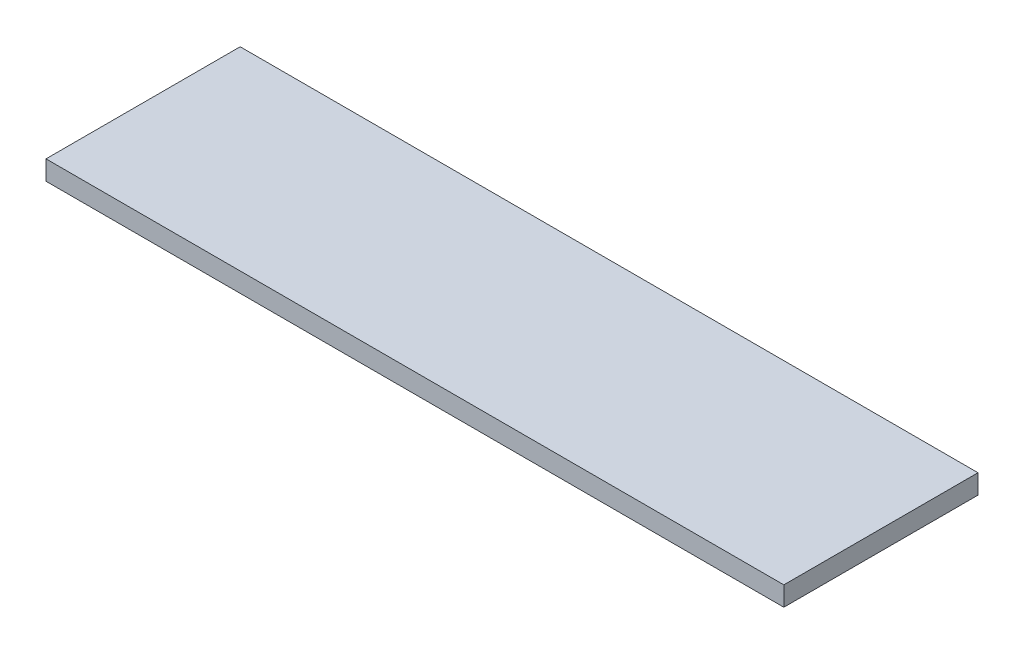
ISO-10303-21;
HEADER;
FILE_DESCRIPTION(('STEP AP214'),'2;1');
FILE_NAME('part.step','',(''),(''),'','','');
FILE_SCHEMA(('AUTOMOTIVE_DESIGN { 1 0 10303 214 1 1 1 1 }'));
ENDSEC;
DATA;
#1=APPLICATION_CONTEXT('core data for automotive mechanical design processes');
#2=APPLICATION_PROTOCOL_DEFINITION('international standard','automotive_design',2000,#1);
#3=PRODUCT_CONTEXT('',#1,'mechanical');
#4=PRODUCT('Part','Part','',(#3));
#5=PRODUCT_RELATED_PRODUCT_CATEGORY('part','',(#4));
#6=PRODUCT_DEFINITION_FORMATION('','',#4);
#7=PRODUCT_DEFINITION_CONTEXT('part definition',#1,'design');
#8=PRODUCT_DEFINITION('design','',#6,#7);
#9=PRODUCT_DEFINITION_SHAPE('','',#8);
#10=(LENGTH_UNIT() NAMED_UNIT(*) SI_UNIT(.MILLI.,.METRE.));
#11=(NAMED_UNIT(*) PLANE_ANGLE_UNIT() SI_UNIT($,.RADIAN.));
#12=(NAMED_UNIT(*) SI_UNIT($,.STERADIAN.) SOLID_ANGLE_UNIT());
#13=UNCERTAINTY_MEASURE_WITH_UNIT(LENGTH_MEASURE(1.E-05),#10,'distance_accuracy_value','');
#14=(GEOMETRIC_REPRESENTATION_CONTEXT(3) GLOBAL_UNCERTAINTY_ASSIGNED_CONTEXT((#13)) GLOBAL_UNIT_ASSIGNED_CONTEXT((#10,
#11,#12)) REPRESENTATION_CONTEXT('',''));
#15=CARTESIAN_POINT('',(0.,0.,0.));
#16=DIRECTION('',(0.,0.,1.));
#17=DIRECTION('',(1.,0.,0.));
#18=AXIS2_PLACEMENT_3D('',#15,#16,#17);
#19=CARTESIAN_POINT('',(0.,100.,0.));
#20=DIRECTION('',(1.,0.,0.));
#21=DIRECTION('',(0.,0.,-1.));
#22=AXIS2_PLACEMENT_3D('',#19,#20,#21);
#23=PLANE('',#22);
#24=DIRECTION('',(0.,0.,1.));
#25=VECTOR('',#24,1.);
#26=CARTESIAN_POINT('',(0.,0.,0.));
#27=LINE('',#26,#25);
#28=CARTESIAN_POINT('',(0.,0.,-1000.));
#29=VERTEX_POINT('',#28);
#30=CARTESIAN_POINT('',(0.,0.,0.));
#31=VERTEX_POINT('',#30);
#32=EDGE_CURVE('E100',#29,#31,#27,.T.);
#33=ORIENTED_EDGE('',*,*,#32,.T.);
#34=DIRECTION('',(0.,-1.,0.));
#35=VECTOR('',#34,1.);
#36=CARTESIAN_POINT('',(0.,100.,0.));
#37=LINE('',#36,#35);
#38=CARTESIAN_POINT('',(0.,100.,0.));
#39=VERTEX_POINT('',#38);
#40=EDGE_CURVE('E11',#39,#31,#37,.T.);
#41=ORIENTED_EDGE('',*,*,#40,.F.);
#42=DIRECTION('',(0.,0.,1.));
#43=VECTOR('',#42,1.);
#44=CARTESIAN_POINT('',(0.,100.,0.));
#45=LINE('',#44,#43);
#46=CARTESIAN_POINT('',(0.,100.,-1000.));
#47=VERTEX_POINT('',#46);
#48=EDGE_CURVE('E88',#47,#39,#45,.T.);
#49=ORIENTED_EDGE('',*,*,#48,.F.);
#50=DIRECTION('',(0.,-1.,0.));
#51=VECTOR('',#50,1.);
#52=CARTESIAN_POINT('',(0.,100.,-1000.));
#53=LINE('',#52,#51);
#54=EDGE_CURVE('E96',#47,#29,#53,.T.);
#55=ORIENTED_EDGE('',*,*,#54,.T.);
#56=EDGE_LOOP('',(#33,#41,#49,#55));
#57=FACE_BOUND('',#56,.T.);
#58=ADVANCED_FACE('F37',(#57),#23,.F.);
#59=CARTESIAN_POINT('',(0.,100.,0.));
#60=DIRECTION('',(0.,0.,-1.));
#61=DIRECTION('',(-1.,0.,0.));
#62=AXIS2_PLACEMENT_3D('',#59,#60,#61);
#63=PLANE('',#62);
#64=DIRECTION('',(1.,0.,0.));
#65=VECTOR('',#64,1.);
#66=CARTESIAN_POINT('',(0.,0.,0.));
#67=LINE('',#66,#65);
#68=CARTESIAN_POINT('',(3800.,0.,0.));
#69=VERTEX_POINT('',#68);
#70=EDGE_CURVE('E92',#31,#69,#67,.T.);
#71=ORIENTED_EDGE('',*,*,#70,.T.);
#72=DIRECTION('',(0.,-1.,0.));
#73=VECTOR('',#72,1.);
#74=CARTESIAN_POINT('',(3800.,100.,0.));
#75=LINE('',#74,#73);
#76=CARTESIAN_POINT('',(3800.,100.,0.));
#77=VERTEX_POINT('',#76);
#78=EDGE_CURVE('E45',#77,#69,#75,.T.);
#79=ORIENTED_EDGE('',*,*,#78,.F.);
#80=DIRECTION('',(1.,0.,0.));
#81=VECTOR('',#80,1.);
#82=CARTESIAN_POINT('',(0.,100.,0.));
#83=LINE('',#82,#81);
#84=EDGE_CURVE('E83',#39,#77,#83,.T.);
#85=ORIENTED_EDGE('',*,*,#84,.F.);
#86=ORIENTED_EDGE('',*,*,#40,.T.);
#87=EDGE_LOOP('',(#71,#79,#85,#86));
#88=FACE_BOUND('',#87,.T.);
#89=ADVANCED_FACE('F91',(#88),#63,.F.);
#90=CARTESIAN_POINT('',(3800.,100.,0.));
#91=DIRECTION('',(-1.,0.,0.));
#92=DIRECTION('',(0.,0.,1.));
#93=AXIS2_PLACEMENT_3D('',#90,#91,#92);
#94=PLANE('',#93);
#95=DIRECTION('',(0.,0.,-1.));
#96=VECTOR('',#95,1.);
#97=CARTESIAN_POINT('',(3800.,0.,0.));
#98=LINE('',#97,#96);
#99=CARTESIAN_POINT('',(3800.,0.,-1000.));
#100=VERTEX_POINT('',#99);
#101=EDGE_CURVE('E70',#69,#100,#98,.T.);
#102=ORIENTED_EDGE('',*,*,#101,.T.);
#103=DIRECTION('',(0.,-1.,0.));
#104=VECTOR('',#103,1.);
#105=CARTESIAN_POINT('',(3800.,100.,-1000.));
#106=LINE('',#105,#104);
#107=CARTESIAN_POINT('',(3800.,100.,-1000.));
#108=VERTEX_POINT('',#107);
#109=EDGE_CURVE('E93',#108,#100,#106,.T.);
#110=ORIENTED_EDGE('',*,*,#109,.F.);
#111=DIRECTION('',(0.,0.,-1.));
#112=VECTOR('',#111,1.);
#113=CARTESIAN_POINT('',(3800.,100.,0.));
#114=LINE('',#113,#112);
#115=EDGE_CURVE('E86',#77,#108,#114,.T.);
#116=ORIENTED_EDGE('',*,*,#115,.F.);
#117=ORIENTED_EDGE('',*,*,#78,.T.);
#118=EDGE_LOOP('',(#102,#110,#116,#117));
#119=FACE_BOUND('',#118,.T.);
#120=ADVANCED_FACE('F94',(#119),#94,.F.);
#121=CARTESIAN_POINT('',(0.,100.,-1000.));
#122=DIRECTION('',(0.,0.,1.));
#123=DIRECTION('',(1.,0.,0.));
#124=AXIS2_PLACEMENT_3D('',#121,#122,#123);
#125=PLANE('',#124);
#126=DIRECTION('',(-1.,0.,0.));
#127=VECTOR('',#126,1.);
#128=CARTESIAN_POINT('',(0.,0.,-1000.));
#129=LINE('',#128,#127);
#130=EDGE_CURVE('E76',#100,#29,#129,.T.);
#131=ORIENTED_EDGE('',*,*,#130,.T.);
#132=ORIENTED_EDGE('',*,*,#54,.F.);
#133=DIRECTION('',(-1.,0.,0.));
#134=VECTOR('',#133,1.);
#135=CARTESIAN_POINT('',(0.,100.,-1000.));
#136=LINE('',#135,#134);
#137=EDGE_CURVE('E53',#108,#47,#136,.T.);
#138=ORIENTED_EDGE('',*,*,#137,.F.);
#139=ORIENTED_EDGE('',*,*,#109,.T.);
#140=EDGE_LOOP('',(#131,#132,#138,#139));
#141=FACE_BOUND('',#140,.T.);
#142=ADVANCED_FACE('F107',(#141),#125,.F.);
#143=CARTESIAN_POINT('',(0.,100.,0.));
#144=DIRECTION('',(0.,-1.,0.));
#145=DIRECTION('',(0.,0.,-1.));
#146=AXIS2_PLACEMENT_3D('',#143,#144,#145);
#147=PLANE('',#146);
#148=ORIENTED_EDGE('',*,*,#48,.T.);
#149=ORIENTED_EDGE('',*,*,#84,.T.);
#150=ORIENTED_EDGE('',*,*,#115,.T.);
#151=ORIENTED_EDGE('',*,*,#137,.T.);
#152=EDGE_LOOP('',(#148,#149,#150,#151));
#153=FACE_BOUND('',#152,.T.);
#154=ADVANCED_FACE('F84',(#153),#147,.F.);
#155=CARTESIAN_POINT('',(0.,0.,0.));
#156=DIRECTION('',(0.,-1.,0.));
#157=DIRECTION('',(0.,0.,-1.));
#158=AXIS2_PLACEMENT_3D('',#155,#156,#157);
#159=PLANE('',#158);
#160=ORIENTED_EDGE('',*,*,#32,.F.);
#161=ORIENTED_EDGE('',*,*,#130,.F.);
#162=ORIENTED_EDGE('',*,*,#101,.F.);
#163=ORIENTED_EDGE('',*,*,#70,.F.);
#164=EDGE_LOOP('',(#160,#161,#162,#163));
#165=FACE_BOUND('',#164,.T.);
#166=ADVANCED_FACE('F110',(#165),#159,.T.);
#167=CLOSED_SHELL('',(#58,#89,#120,#142,#154,#166));
#168=MANIFOLD_SOLID_BREP('B2',#167);
#169=ADVANCED_BREP_SHAPE_REPRESENTATION('',(#18,#168),#14);
#170=SHAPE_DEFINITION_REPRESENTATION(#9,#169);
ENDSEC;
END-ISO-10303-21;
